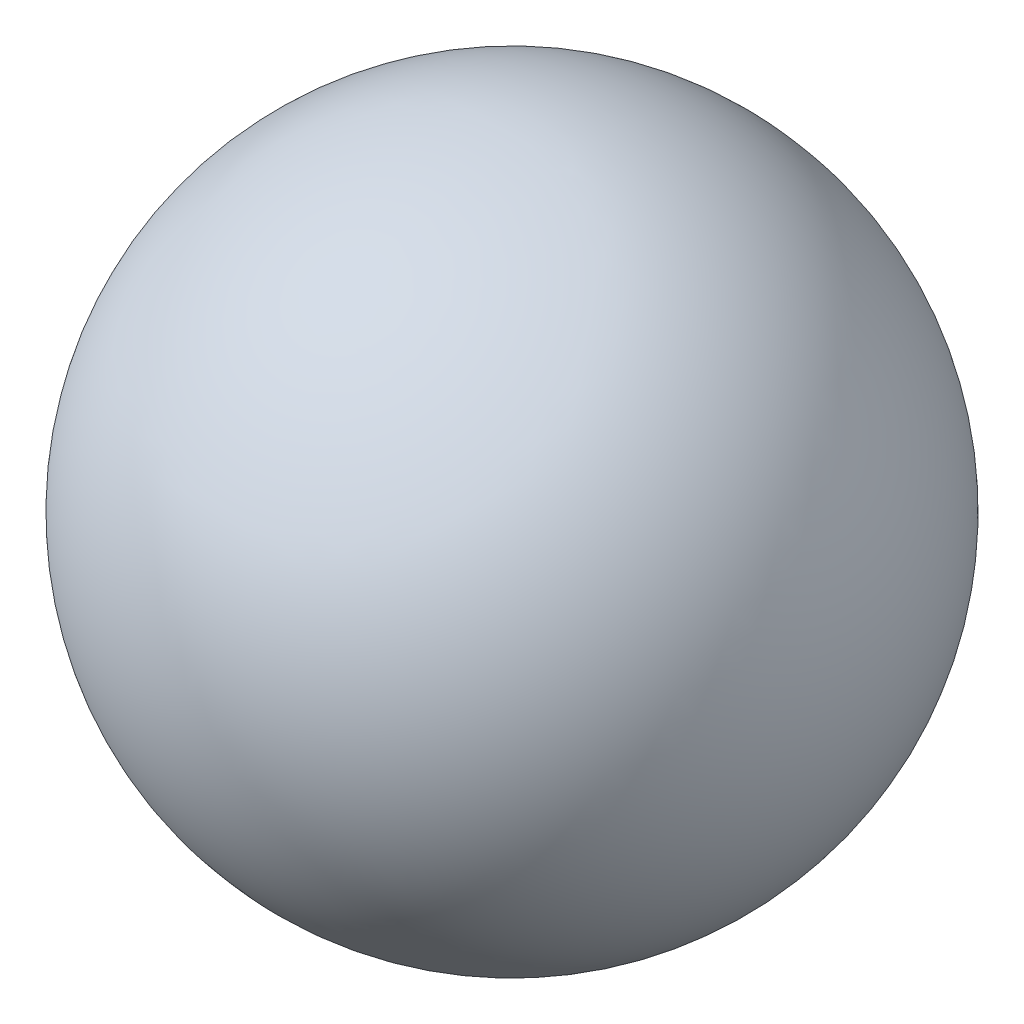
ISO-10303-21;
HEADER;
FILE_DESCRIPTION(('STEP AP214'),'2;1');
FILE_NAME('part.step','',(''),(''),'','','');
FILE_SCHEMA(('AUTOMOTIVE_DESIGN { 1 0 10303 214 1 1 1 1 }'));
ENDSEC;
DATA;
#1=APPLICATION_CONTEXT('core data for automotive mechanical design processes');
#2=APPLICATION_PROTOCOL_DEFINITION('international standard','automotive_design',2000,#1);
#3=PRODUCT_CONTEXT('',#1,'mechanical');
#4=PRODUCT('Part','Part','',(#3));
#5=PRODUCT_RELATED_PRODUCT_CATEGORY('part','',(#4));
#6=PRODUCT_DEFINITION_FORMATION('','',#4);
#7=PRODUCT_DEFINITION_CONTEXT('part definition',#1,'design');
#8=PRODUCT_DEFINITION('design','',#6,#7);
#9=PRODUCT_DEFINITION_SHAPE('','',#8);
#10=(LENGTH_UNIT() NAMED_UNIT(*) SI_UNIT(.MILLI.,.METRE.));
#11=(NAMED_UNIT(*) PLANE_ANGLE_UNIT() SI_UNIT($,.RADIAN.));
#12=(NAMED_UNIT(*) SI_UNIT($,.STERADIAN.) SOLID_ANGLE_UNIT());
#13=UNCERTAINTY_MEASURE_WITH_UNIT(LENGTH_MEASURE(1.E-05),#10,'distance_accuracy_value','');
#14=(GEOMETRIC_REPRESENTATION_CONTEXT(3) GLOBAL_UNCERTAINTY_ASSIGNED_CONTEXT((#13)) GLOBAL_UNIT_ASSIGNED_CONTEXT((#10,
#11,#12)) REPRESENTATION_CONTEXT('',''));
#15=CARTESIAN_POINT('',(0.,0.,0.));
#16=DIRECTION('',(0.,0.,1.));
#17=DIRECTION('',(1.,0.,0.));
#18=AXIS2_PLACEMENT_3D('',#15,#16,#17);
#19=CARTESIAN_POINT('',(57.535,32.4283487978463,-52.2927116001381));
#20=DIRECTION('',(0.,0.527020287134986,-0.84985270308928));
#21=DIRECTION('',(0.173648177666934,0.836941530920705,0.519013664765254));
#22=AXIS2_PLACEMENT_3D('',#19,#20,#21);
#23=SPHERICAL_SURFACE('',#22,6.75);
#24=CARTESIAN_POINT('',(57.535,28.8709618596851,-46.5562058542855));
#25=VERTEX_POINT('',#24);
#26=VERTEX_LOOP('',#25);
#27=FACE_BOUND('',#26,.T.);
#28=CARTESIAN_POINT('',(57.535,35.9857357360075,-58.0292173459907));
#29=VERTEX_POINT('',#28);
#30=VERTEX_LOOP('',#29);
#31=FACE_BOUND('',#30,.T.);
#32=ADVANCED_FACE('F16',(#27,#31),#23,.T.);
#33=CLOSED_SHELL('',(#32));
#34=MANIFOLD_SOLID_BREP('B1',#33);
#35=ADVANCED_BREP_SHAPE_REPRESENTATION('',(#18,#34),#14);
#36=SHAPE_DEFINITION_REPRESENTATION(#9,#35);
ENDSEC;
END-ISO-10303-21;
